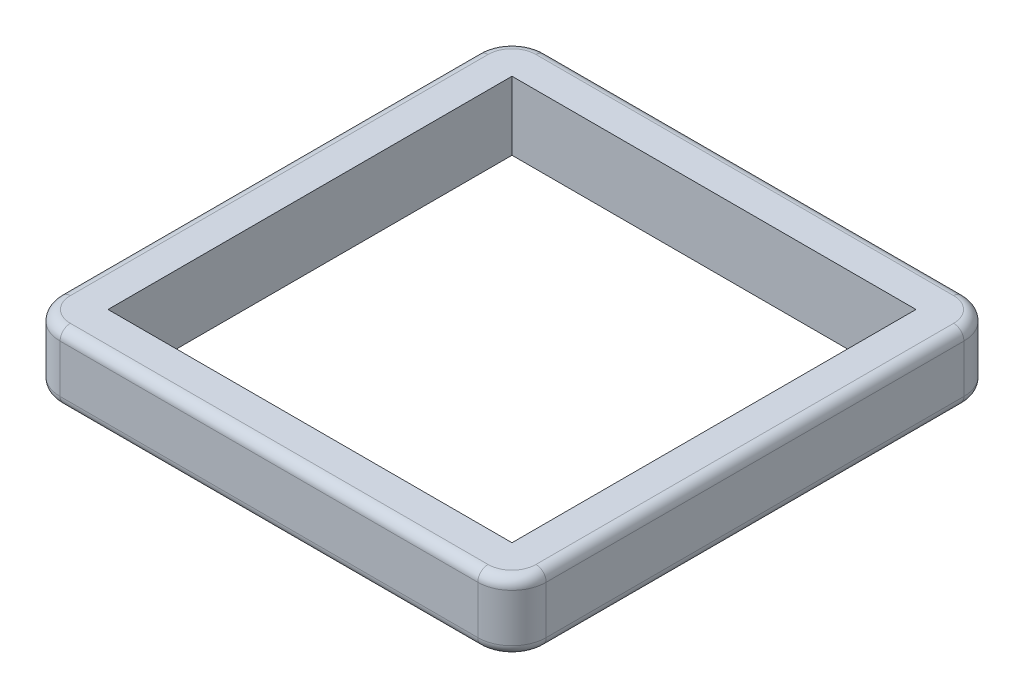
ISO-10303-21;
HEADER;
FILE_DESCRIPTION(('STEP AP214'),'2;1');
FILE_NAME('part.step','',(''),(''),'','','');
FILE_SCHEMA(('AUTOMOTIVE_DESIGN { 1 0 10303 214 1 1 1 1 }'));
ENDSEC;
DATA;
#1=APPLICATION_CONTEXT('core data for automotive mechanical design processes');
#2=APPLICATION_PROTOCOL_DEFINITION('international standard','automotive_design',2000,#1);
#3=PRODUCT_CONTEXT('',#1,'mechanical');
#4=PRODUCT('Part','Part','',(#3));
#5=PRODUCT_RELATED_PRODUCT_CATEGORY('part','',(#4));
#6=PRODUCT_DEFINITION_FORMATION('','',#4);
#7=PRODUCT_DEFINITION_CONTEXT('part definition',#1,'design');
#8=PRODUCT_DEFINITION('design','',#6,#7);
#9=PRODUCT_DEFINITION_SHAPE('','',#8);
#10=(LENGTH_UNIT() NAMED_UNIT(*) SI_UNIT(.MILLI.,.METRE.));
#11=(NAMED_UNIT(*) PLANE_ANGLE_UNIT() SI_UNIT($,.RADIAN.));
#12=(NAMED_UNIT(*) SI_UNIT($,.STERADIAN.) SOLID_ANGLE_UNIT());
#13=UNCERTAINTY_MEASURE_WITH_UNIT(LENGTH_MEASURE(1.E-05),#10,'distance_accuracy_value','');
#14=(GEOMETRIC_REPRESENTATION_CONTEXT(3) GLOBAL_UNCERTAINTY_ASSIGNED_CONTEXT((#13)) GLOBAL_UNIT_ASSIGNED_CONTEXT((#10,
#11,#12)) REPRESENTATION_CONTEXT('',''));
#15=CARTESIAN_POINT('',(0.,0.,0.));
#16=DIRECTION('',(0.,0.,1.));
#17=DIRECTION('',(1.,0.,0.));
#18=AXIS2_PLACEMENT_3D('',#15,#16,#17);
#19=CARTESIAN_POINT('',(0.,127.,0.));
#20=DIRECTION('',(0.,1.,0.));
#21=DIRECTION('',(0.,0.,1.));
#22=AXIS2_PLACEMENT_3D('',#19,#20,#21);
#23=PLANE('',#22);
#24=DIRECTION('',(1.,0.,0.));
#25=VECTOR('',#24,1.);
#26=CARTESIAN_POINT('',(387.35,127.,431.8));
#27=LINE('',#26,#25);
#28=CARTESIAN_POINT('',(-387.35,127.,431.8));
#29=VERTEX_POINT('',#28);
#30=CARTESIAN_POINT('',(387.35,127.,431.8));
#31=VERTEX_POINT('',#30);
#32=EDGE_CURVE('E63',#29,#31,#27,.T.);
#33=ORIENTED_EDGE('',*,*,#32,.T.);
#34=CARTESIAN_POINT('',(387.35,127.,387.35));
#35=DIRECTION('',(0.,1.,0.));
#36=DIRECTION('',(0.,0.,1.));
#37=AXIS2_PLACEMENT_3D('',#34,#35,#36);
#38=CIRCLE('',#37,44.45);
#39=CARTESIAN_POINT('',(431.8,127.,387.35));
#40=VERTEX_POINT('',#39);
#41=EDGE_CURVE('E358',#31,#40,#38,.T.);
#42=ORIENTED_EDGE('',*,*,#41,.T.);
#43=DIRECTION('',(0.,0.,-1.));
#44=VECTOR('',#43,1.);
#45=CARTESIAN_POINT('',(431.8,127.,-387.35));
#46=LINE('',#45,#44);
#47=CARTESIAN_POINT('',(431.8,127.,-387.35));
#48=VERTEX_POINT('',#47);
#49=EDGE_CURVE('E339',#40,#48,#46,.T.);
#50=ORIENTED_EDGE('',*,*,#49,.T.);
#51=CARTESIAN_POINT('',(387.35,127.,-387.35));
#52=DIRECTION('',(0.,1.,0.));
#53=DIRECTION('',(0.,0.,1.));
#54=AXIS2_PLACEMENT_3D('',#51,#52,#53);
#55=CIRCLE('',#54,44.45);
#56=CARTESIAN_POINT('',(387.35,127.,-431.8));
#57=VERTEX_POINT('',#56);
#58=EDGE_CURVE('E342',#48,#57,#55,.T.);
#59=ORIENTED_EDGE('',*,*,#58,.T.);
#60=DIRECTION('',(-1.,0.,0.));
#61=VECTOR('',#60,1.);
#62=CARTESIAN_POINT('',(-387.35,127.,-431.8));
#63=LINE('',#62,#61);
#64=CARTESIAN_POINT('',(-387.35,127.,-431.8));
#65=VERTEX_POINT('',#64);
#66=EDGE_CURVE('E345',#57,#65,#63,.T.);
#67=ORIENTED_EDGE('',*,*,#66,.T.);
#68=CARTESIAN_POINT('',(-387.35,127.,-387.35));
#69=DIRECTION('',(0.,1.,0.));
#70=DIRECTION('',(0.,0.,1.));
#71=AXIS2_PLACEMENT_3D('',#68,#69,#70);
#72=CIRCLE('',#71,44.45);
#73=CARTESIAN_POINT('',(-431.8,127.,-387.35));
#74=VERTEX_POINT('',#73);
#75=EDGE_CURVE('E348',#65,#74,#72,.T.);
#76=ORIENTED_EDGE('',*,*,#75,.T.);
#77=DIRECTION('',(0.,0.,1.));
#78=VECTOR('',#77,1.);
#79=CARTESIAN_POINT('',(-431.8,127.,387.35));
#80=LINE('',#79,#78);
#81=CARTESIAN_POINT('',(-431.8,127.,387.35));
#82=VERTEX_POINT('',#81);
#83=EDGE_CURVE('E351',#74,#82,#80,.T.);
#84=ORIENTED_EDGE('',*,*,#83,.T.);
#85=CARTESIAN_POINT('',(-387.35,127.,387.35));
#86=DIRECTION('',(0.,1.,0.));
#87=DIRECTION('',(0.,0.,1.));
#88=AXIS2_PLACEMENT_3D('',#85,#86,#87);
#89=CIRCLE('',#88,44.45);
#90=EDGE_CURVE('E68',#82,#29,#89,.T.);
#91=ORIENTED_EDGE('',*,*,#90,.T.);
#92=EDGE_LOOP('',(#33,#42,#50,#59,#67,#76,#84,#91));
#93=FACE_BOUND('',#92,.T.);
#94=DIRECTION('',(-1.,0.,0.));
#95=VECTOR('',#94,1.);
#96=CARTESIAN_POINT('',(-374.65,127.,-374.65));
#97=LINE('',#96,#95);
#98=CARTESIAN_POINT('',(374.65,127.,-374.65));
#99=VERTEX_POINT('',#98);
#100=CARTESIAN_POINT('',(-374.65,127.,-374.65));
#101=VERTEX_POINT('',#100);
#102=EDGE_CURVE('E196',#99,#101,#97,.T.);
#103=ORIENTED_EDGE('',*,*,#102,.F.);
#104=DIRECTION('',(0.,0.,-1.));
#105=VECTOR('',#104,1.);
#106=CARTESIAN_POINT('',(374.65,127.,-374.65));
#107=LINE('',#106,#105);
#108=CARTESIAN_POINT('',(374.65,127.,374.65));
#109=VERTEX_POINT('',#108);
#110=EDGE_CURVE('E185',#109,#99,#107,.T.);
#111=ORIENTED_EDGE('',*,*,#110,.F.);
#112=DIRECTION('',(1.,0.,0.));
#113=VECTOR('',#112,1.);
#114=CARTESIAN_POINT('',(-374.65,127.,374.65));
#115=LINE('',#114,#113);
#116=CARTESIAN_POINT('',(-374.65,127.,374.65));
#117=VERTEX_POINT('',#116);
#118=EDGE_CURVE('E214',#117,#109,#115,.T.);
#119=ORIENTED_EDGE('',*,*,#118,.F.);
#120=DIRECTION('',(0.,0.,1.));
#121=VECTOR('',#120,1.);
#122=CARTESIAN_POINT('',(-374.65,127.,-374.65));
#123=LINE('',#122,#121);
#124=EDGE_CURVE('E210',#101,#117,#123,.T.);
#125=ORIENTED_EDGE('',*,*,#124,.F.);
#126=EDGE_LOOP('',(#103,#111,#119,#125));
#127=FACE_BOUND('',#126,.T.);
#128=ADVANCED_FACE('F45',(#93,#127),#23,.T.);
#129=CARTESIAN_POINT('',(0.,0.,0.));
#130=DIRECTION('',(0.,1.,0.));
#131=DIRECTION('',(0.,0.,1.));
#132=AXIS2_PLACEMENT_3D('',#129,#130,#131);
#133=PLANE('',#132);
#134=DIRECTION('',(0.,0.,-1.));
#135=VECTOR('',#134,1.);
#136=CARTESIAN_POINT('',(431.8,0.,0.));
#137=LINE('',#136,#135);
#138=CARTESIAN_POINT('',(431.8,0.,-387.35));
#139=VERTEX_POINT('',#138);
#140=CARTESIAN_POINT('',(431.8,0.,387.35));
#141=VERTEX_POINT('',#140);
#142=EDGE_CURVE('E270',#139,#141,#137,.F.);
#143=ORIENTED_EDGE('',*,*,#142,.T.);
#144=CARTESIAN_POINT('',(387.35,0.,387.35));
#145=DIRECTION('',(0.,1.,0.));
#146=DIRECTION('',(0.,0.,1.));
#147=AXIS2_PLACEMENT_3D('',#144,#145,#146);
#148=CIRCLE('',#147,44.45);
#149=CARTESIAN_POINT('',(387.35,0.,431.8));
#150=VERTEX_POINT('',#149);
#151=EDGE_CURVE('E291',#141,#150,#148,.F.);
#152=ORIENTED_EDGE('',*,*,#151,.T.);
#153=DIRECTION('',(1.,0.,0.));
#154=VECTOR('',#153,1.);
#155=CARTESIAN_POINT('',(0.,0.,431.8));
#156=LINE('',#155,#154);
#157=CARTESIAN_POINT('',(-387.35,0.,431.8));
#158=VERTEX_POINT('',#157);
#159=EDGE_CURVE('E288',#150,#158,#156,.F.);
#160=ORIENTED_EDGE('',*,*,#159,.T.);
#161=CARTESIAN_POINT('',(-387.35,0.,387.35));
#162=DIRECTION('',(0.,1.,0.));
#163=DIRECTION('',(0.,0.,1.));
#164=AXIS2_PLACEMENT_3D('',#161,#162,#163);
#165=CIRCLE('',#164,44.45);
#166=CARTESIAN_POINT('',(-431.8,0.,387.35));
#167=VERTEX_POINT('',#166);
#168=EDGE_CURVE('E285',#158,#167,#165,.F.);
#169=ORIENTED_EDGE('',*,*,#168,.T.);
#170=DIRECTION('',(0.,0.,1.));
#171=VECTOR('',#170,1.);
#172=CARTESIAN_POINT('',(-431.8,0.,0.));
#173=LINE('',#172,#171);
#174=CARTESIAN_POINT('',(-431.8,0.,-387.35));
#175=VERTEX_POINT('',#174);
#176=EDGE_CURVE('E282',#167,#175,#173,.F.);
#177=ORIENTED_EDGE('',*,*,#176,.T.);
#178=CARTESIAN_POINT('',(-387.35,0.,-387.35));
#179=DIRECTION('',(0.,1.,0.));
#180=DIRECTION('',(0.,0.,1.));
#181=AXIS2_PLACEMENT_3D('',#178,#179,#180);
#182=CIRCLE('',#181,44.45);
#183=CARTESIAN_POINT('',(-387.35,0.,-431.8));
#184=VERTEX_POINT('',#183);
#185=EDGE_CURVE('E279',#175,#184,#182,.F.);
#186=ORIENTED_EDGE('',*,*,#185,.T.);
#187=DIRECTION('',(-1.,0.,0.));
#188=VECTOR('',#187,1.);
#189=CARTESIAN_POINT('',(0.,0.,-431.8));
#190=LINE('',#189,#188);
#191=CARTESIAN_POINT('',(387.35,0.,-431.8));
#192=VERTEX_POINT('',#191);
#193=EDGE_CURVE('E276',#184,#192,#190,.F.);
#194=ORIENTED_EDGE('',*,*,#193,.T.);
#195=CARTESIAN_POINT('',(387.35,0.,-387.35));
#196=DIRECTION('',(0.,1.,0.));
#197=DIRECTION('',(0.,0.,1.));
#198=AXIS2_PLACEMENT_3D('',#195,#196,#197);
#199=CIRCLE('',#198,44.45);
#200=EDGE_CURVE('E273',#192,#139,#199,.F.);
#201=ORIENTED_EDGE('',*,*,#200,.T.);
#202=EDGE_LOOP('',(#143,#152,#160,#169,#177,#186,#194,#201));
#203=FACE_BOUND('',#202,.T.);
#204=DIRECTION('',(0.,0.,-1.));
#205=VECTOR('',#204,1.);
#206=CARTESIAN_POINT('',(374.65,0.,-374.65));
#207=LINE('',#206,#205);
#208=CARTESIAN_POINT('',(374.65,0.,374.65));
#209=VERTEX_POINT('',#208);
#210=CARTESIAN_POINT('',(374.65,0.,-374.65));
#211=VERTEX_POINT('',#210);
#212=EDGE_CURVE('E219',#209,#211,#207,.T.);
#213=ORIENTED_EDGE('',*,*,#212,.T.);
#214=DIRECTION('',(-1.,0.,0.));
#215=VECTOR('',#214,1.);
#216=CARTESIAN_POINT('',(-374.65,0.,-374.65));
#217=LINE('',#216,#215);
#218=CARTESIAN_POINT('',(-374.65,0.,-374.65));
#219=VERTEX_POINT('',#218);
#220=EDGE_CURVE('E203',#211,#219,#217,.T.);
#221=ORIENTED_EDGE('',*,*,#220,.T.);
#222=DIRECTION('',(0.,0.,1.));
#223=VECTOR('',#222,1.);
#224=CARTESIAN_POINT('',(-374.65,0.,-374.65));
#225=LINE('',#224,#223);
#226=CARTESIAN_POINT('',(-374.65,0.,374.65));
#227=VERTEX_POINT('',#226);
#228=EDGE_CURVE('E225',#219,#227,#225,.T.);
#229=ORIENTED_EDGE('',*,*,#228,.T.);
#230=DIRECTION('',(1.,0.,0.));
#231=VECTOR('',#230,1.);
#232=CARTESIAN_POINT('',(-374.65,0.,374.65));
#233=LINE('',#232,#231);
#234=EDGE_CURVE('E197',#227,#209,#233,.T.);
#235=ORIENTED_EDGE('',*,*,#234,.T.);
#236=EDGE_LOOP('',(#213,#221,#229,#235));
#237=FACE_BOUND('',#236,.T.);
#238=ADVANCED_FACE('F452',(#203,#237),#133,.F.);
#239=CARTESIAN_POINT('',(-450.85,127.,-450.85));
#240=DIRECTION('',(1.,0.,0.));
#241=DIRECTION('',(0.,0.,-1.));
#242=AXIS2_PLACEMENT_3D('',#239,#240,#241);
#243=PLANE('',#242);
#244=DIRECTION('',(0.,-1.,0.));
#245=VECTOR('',#244,1.);
#246=CARTESIAN_POINT('',(-450.85,127.,-387.35));
#247=LINE('',#246,#245);
#248=CARTESIAN_POINT('',(-450.85,107.95,-387.35));
#249=VERTEX_POINT('',#248);
#250=CARTESIAN_POINT('',(-450.85,19.05,-387.35));
#251=VERTEX_POINT('',#250);
#252=EDGE_CURVE('E242',#249,#251,#247,.T.);
#253=ORIENTED_EDGE('',*,*,#252,.T.);
#254=DIRECTION('',(0.,0.,1.));
#255=VECTOR('',#254,1.);
#256=CARTESIAN_POINT('',(-450.85,19.05,-450.85));
#257=LINE('',#256,#255);
#258=CARTESIAN_POINT('',(-450.85,19.05,387.35));
#259=VERTEX_POINT('',#258);
#260=EDGE_CURVE('E318',#251,#259,#257,.T.);
#261=ORIENTED_EDGE('',*,*,#260,.T.);
#262=DIRECTION('',(0.,-1.,0.));
#263=VECTOR('',#262,1.);
#264=CARTESIAN_POINT('',(-450.85,127.,387.35));
#265=LINE('',#264,#263);
#266=CARTESIAN_POINT('',(-450.85,107.95,387.35));
#267=VERTEX_POINT('',#266);
#268=EDGE_CURVE('E205',#259,#267,#265,.F.);
#269=ORIENTED_EDGE('',*,*,#268,.T.);
#270=DIRECTION('',(0.,0.,1.));
#271=VECTOR('',#270,1.);
#272=CARTESIAN_POINT('',(-450.85,107.95,-387.35));
#273=LINE('',#272,#271);
#274=EDGE_CURVE('E315',#267,#249,#273,.F.);
#275=ORIENTED_EDGE('',*,*,#274,.T.);
#276=EDGE_LOOP('',(#253,#261,#269,#275));
#277=FACE_BOUND('',#276,.T.);
#278=ADVANCED_FACE('F462',(#277),#243,.F.);
#279=CARTESIAN_POINT('',(-450.85,127.,450.85));
#280=DIRECTION('',(0.,0.,-1.));
#281=DIRECTION('',(-1.,0.,0.));
#282=AXIS2_PLACEMENT_3D('',#279,#280,#281);
#283=PLANE('',#282);
#284=DIRECTION('',(0.,-1.,0.));
#285=VECTOR('',#284,1.);
#286=CARTESIAN_POINT('',(-387.35,127.,450.85));
#287=LINE('',#286,#285);
#288=CARTESIAN_POINT('',(-387.35,107.95,450.85));
#289=VERTEX_POINT('',#288);
#290=CARTESIAN_POINT('',(-387.35,19.05,450.85));
#291=VERTEX_POINT('',#290);
#292=EDGE_CURVE('E262',#289,#291,#287,.T.);
#293=ORIENTED_EDGE('',*,*,#292,.T.);
#294=DIRECTION('',(1.,0.,0.));
#295=VECTOR('',#294,1.);
#296=CARTESIAN_POINT('',(-450.85,19.05,450.85));
#297=LINE('',#296,#295);
#298=CARTESIAN_POINT('',(387.35,19.05,450.85));
#299=VERTEX_POINT('',#298);
#300=EDGE_CURVE('E306',#291,#299,#297,.T.);
#301=ORIENTED_EDGE('',*,*,#300,.T.);
#302=DIRECTION('',(0.,-1.,0.));
#303=VECTOR('',#302,1.);
#304=CARTESIAN_POINT('',(387.35,127.,450.85));
#305=LINE('',#304,#303);
#306=CARTESIAN_POINT('',(387.35,107.95,450.85));
#307=VERTEX_POINT('',#306);
#308=EDGE_CURVE('E266',#299,#307,#305,.F.);
#309=ORIENTED_EDGE('',*,*,#308,.T.);
#310=DIRECTION('',(1.,0.,0.));
#311=VECTOR('',#310,1.);
#312=CARTESIAN_POINT('',(-387.35,107.95,450.85));
#313=LINE('',#312,#311);
#314=EDGE_CURVE('E303',#307,#289,#313,.F.);
#315=ORIENTED_EDGE('',*,*,#314,.T.);
#316=EDGE_LOOP('',(#293,#301,#309,#315));
#317=FACE_BOUND('',#316,.T.);
#318=ADVANCED_FACE('F483',(#317),#283,.F.);
#319=CARTESIAN_POINT('',(450.85,127.,-450.85));
#320=DIRECTION('',(-1.,0.,0.));
#321=DIRECTION('',(0.,0.,1.));
#322=AXIS2_PLACEMENT_3D('',#319,#320,#321);
#323=PLANE('',#322);
#324=DIRECTION('',(0.,-1.,0.));
#325=VECTOR('',#324,1.);
#326=CARTESIAN_POINT('',(450.85,127.,387.35));
#327=LINE('',#326,#325);
#328=CARTESIAN_POINT('',(450.85,107.95,387.35));
#329=VERTEX_POINT('',#328);
#330=CARTESIAN_POINT('',(450.85,19.05,387.35));
#331=VERTEX_POINT('',#330);
#332=EDGE_CURVE('E254',#329,#331,#327,.T.);
#333=ORIENTED_EDGE('',*,*,#332,.T.);
#334=DIRECTION('',(0.,0.,-1.));
#335=VECTOR('',#334,1.);
#336=CARTESIAN_POINT('',(450.85,19.05,-450.85));
#337=LINE('',#336,#335);
#338=CARTESIAN_POINT('',(450.85,19.05,-387.35));
#339=VERTEX_POINT('',#338);
#340=EDGE_CURVE('E11',#331,#339,#337,.T.);
#341=ORIENTED_EDGE('',*,*,#340,.T.);
#342=DIRECTION('',(0.,-1.,0.));
#343=VECTOR('',#342,1.);
#344=CARTESIAN_POINT('',(450.85,127.,-387.35));
#345=LINE('',#344,#343);
#346=CARTESIAN_POINT('',(450.85,107.95,-387.35));
#347=VERTEX_POINT('',#346);
#348=EDGE_CURVE('E258',#339,#347,#345,.F.);
#349=ORIENTED_EDGE('',*,*,#348,.T.);
#350=DIRECTION('',(0.,0.,-1.));
#351=VECTOR('',#350,1.);
#352=CARTESIAN_POINT('',(450.85,107.95,387.35));
#353=LINE('',#352,#351);
#354=EDGE_CURVE('E55',#347,#329,#353,.F.);
#355=ORIENTED_EDGE('',*,*,#354,.T.);
#356=EDGE_LOOP('',(#333,#341,#349,#355));
#357=FACE_BOUND('',#356,.T.);
#358=ADVANCED_FACE('F497',(#357),#323,.F.);
#359=CARTESIAN_POINT('',(-450.85,127.,-450.85));
#360=DIRECTION('',(0.,0.,1.));
#361=DIRECTION('',(1.,0.,0.));
#362=AXIS2_PLACEMENT_3D('',#359,#360,#361);
#363=PLANE('',#362);
#364=DIRECTION('',(0.,-1.,0.));
#365=VECTOR('',#364,1.);
#366=CARTESIAN_POINT('',(387.35,127.,-450.85));
#367=LINE('',#366,#365);
#368=CARTESIAN_POINT('',(387.35,107.95,-450.85));
#369=VERTEX_POINT('',#368);
#370=CARTESIAN_POINT('',(387.35,19.05,-450.85));
#371=VERTEX_POINT('',#370);
#372=EDGE_CURVE('E246',#369,#371,#367,.T.);
#373=ORIENTED_EDGE('',*,*,#372,.T.);
#374=DIRECTION('',(-1.,0.,0.));
#375=VECTOR('',#374,1.);
#376=CARTESIAN_POINT('',(-450.85,19.05,-450.85));
#377=LINE('',#376,#375);
#378=CARTESIAN_POINT('',(-387.35,19.05,-450.85));
#379=VERTEX_POINT('',#378);
#380=EDGE_CURVE('E330',#371,#379,#377,.T.);
#381=ORIENTED_EDGE('',*,*,#380,.T.);
#382=DIRECTION('',(0.,-1.,0.));
#383=VECTOR('',#382,1.);
#384=CARTESIAN_POINT('',(-387.35,127.,-450.85));
#385=LINE('',#384,#383);
#386=CARTESIAN_POINT('',(-387.35,107.95,-450.85));
#387=VERTEX_POINT('',#386);
#388=EDGE_CURVE('E250',#379,#387,#385,.F.);
#389=ORIENTED_EDGE('',*,*,#388,.T.);
#390=DIRECTION('',(-1.,0.,0.));
#391=VECTOR('',#390,1.);
#392=CARTESIAN_POINT('',(387.35,107.95,-450.85));
#393=LINE('',#392,#391);
#394=EDGE_CURVE('E327',#387,#369,#393,.F.);
#395=ORIENTED_EDGE('',*,*,#394,.T.);
#396=EDGE_LOOP('',(#373,#381,#389,#395));
#397=FACE_BOUND('',#396,.T.);
#398=ADVANCED_FACE('F437',(#397),#363,.F.);
#399=CARTESIAN_POINT('',(374.65,127.,-374.65));
#400=DIRECTION('',(-1.,0.,0.));
#401=DIRECTION('',(0.,0.,1.));
#402=AXIS2_PLACEMENT_3D('',#399,#400,#401);
#403=PLANE('',#402);
#404=ORIENTED_EDGE('',*,*,#212,.F.);
#405=DIRECTION('',(0.,-1.,0.));
#406=VECTOR('',#405,1.);
#407=CARTESIAN_POINT('',(374.65,127.,374.65));
#408=LINE('',#407,#406);
#409=EDGE_CURVE('E191',#109,#209,#408,.T.);
#410=ORIENTED_EDGE('',*,*,#409,.F.);
#411=ORIENTED_EDGE('',*,*,#110,.T.);
#412=DIRECTION('',(0.,-1.,0.));
#413=VECTOR('',#412,1.);
#414=CARTESIAN_POINT('',(374.65,127.,-374.65));
#415=LINE('',#414,#413);
#416=EDGE_CURVE('E188',#99,#211,#415,.T.);
#417=ORIENTED_EDGE('',*,*,#416,.T.);
#418=EDGE_LOOP('',(#404,#410,#411,#417));
#419=FACE_BOUND('',#418,.T.);
#420=ADVANCED_FACE('F187',(#419),#403,.T.);
#421=CARTESIAN_POINT('',(-374.65,127.,-374.65));
#422=DIRECTION('',(0.,0.,1.));
#423=DIRECTION('',(1.,0.,0.));
#424=AXIS2_PLACEMENT_3D('',#421,#422,#423);
#425=PLANE('',#424);
#426=ORIENTED_EDGE('',*,*,#220,.F.);
#427=ORIENTED_EDGE('',*,*,#416,.F.);
#428=ORIENTED_EDGE('',*,*,#102,.T.);
#429=DIRECTION('',(0.,-1.,0.));
#430=VECTOR('',#429,1.);
#431=CARTESIAN_POINT('',(-374.65,127.,-374.65));
#432=LINE('',#431,#430);
#433=EDGE_CURVE('E206',#101,#219,#432,.T.);
#434=ORIENTED_EDGE('',*,*,#433,.T.);
#435=EDGE_LOOP('',(#426,#427,#428,#434));
#436=FACE_BOUND('',#435,.T.);
#437=ADVANCED_FACE('F200',(#436),#425,.T.);
#438=CARTESIAN_POINT('',(-374.65,127.,-374.65));
#439=DIRECTION('',(1.,0.,0.));
#440=DIRECTION('',(0.,0.,-1.));
#441=AXIS2_PLACEMENT_3D('',#438,#439,#440);
#442=PLANE('',#441);
#443=ORIENTED_EDGE('',*,*,#228,.F.);
#444=ORIENTED_EDGE('',*,*,#433,.F.);
#445=ORIENTED_EDGE('',*,*,#124,.T.);
#446=DIRECTION('',(0.,-1.,0.));
#447=VECTOR('',#446,1.);
#448=CARTESIAN_POINT('',(-374.65,127.,374.65));
#449=LINE('',#448,#447);
#450=EDGE_CURVE('E234',#117,#227,#449,.T.);
#451=ORIENTED_EDGE('',*,*,#450,.T.);
#452=EDGE_LOOP('',(#443,#444,#445,#451));
#453=FACE_BOUND('',#452,.T.);
#454=ADVANCED_FACE('F736',(#453),#442,.T.);
#455=CARTESIAN_POINT('',(-374.65,127.,374.65));
#456=DIRECTION('',(0.,0.,-1.));
#457=DIRECTION('',(-1.,0.,0.));
#458=AXIS2_PLACEMENT_3D('',#455,#456,#457);
#459=PLANE('',#458);
#460=ORIENTED_EDGE('',*,*,#234,.F.);
#461=ORIENTED_EDGE('',*,*,#450,.F.);
#462=ORIENTED_EDGE('',*,*,#118,.T.);
#463=ORIENTED_EDGE('',*,*,#409,.T.);
#464=EDGE_LOOP('',(#460,#461,#462,#463));
#465=FACE_BOUND('',#464,.T.);
#466=ADVANCED_FACE('F547',(#465),#459,.T.);
#467=CARTESIAN_POINT('',(-387.35,127.,-387.35));
#468=DIRECTION('',(0.,-1.,0.));
#469=DIRECTION('',(0.,0.,-1.));
#470=AXIS2_PLACEMENT_3D('',#467,#468,#469);
#471=CYLINDRICAL_SURFACE('',#470,63.5);
#472=ORIENTED_EDGE('',*,*,#388,.F.);
#473=CARTESIAN_POINT('',(-387.35,19.05,-387.35));
#474=DIRECTION('',(0.,1.,0.));
#475=DIRECTION('',(0.,0.,1.));
#476=AXIS2_PLACEMENT_3D('',#473,#474,#475);
#477=CIRCLE('',#476,63.5);
#478=EDGE_CURVE('E324',#379,#251,#477,.T.);
#479=ORIENTED_EDGE('',*,*,#478,.T.);
#480=ORIENTED_EDGE('',*,*,#252,.F.);
#481=CARTESIAN_POINT('',(-387.35,107.95,-387.35));
#482=DIRECTION('',(0.,1.,0.));
#483=DIRECTION('',(0.,0.,1.));
#484=AXIS2_PLACEMENT_3D('',#481,#482,#483);
#485=CIRCLE('',#484,63.5);
#486=EDGE_CURVE('E321',#249,#387,#485,.F.);
#487=ORIENTED_EDGE('',*,*,#486,.T.);
#488=EDGE_LOOP('',(#472,#479,#480,#487));
#489=FACE_BOUND('',#488,.T.);
#490=ADVANCED_FACE('F434',(#489),#471,.T.);
#491=CARTESIAN_POINT('',(387.35,127.,-387.35));
#492=DIRECTION('',(0.,-1.,0.));
#493=DIRECTION('',(0.,0.,-1.));
#494=AXIS2_PLACEMENT_3D('',#491,#492,#493);
#495=CYLINDRICAL_SURFACE('',#494,63.5);
#496=ORIENTED_EDGE('',*,*,#348,.F.);
#497=CARTESIAN_POINT('',(387.35,19.05,-387.35));
#498=DIRECTION('',(0.,1.,0.));
#499=DIRECTION('',(0.,0.,1.));
#500=AXIS2_PLACEMENT_3D('',#497,#498,#499);
#501=CIRCLE('',#500,63.5);
#502=EDGE_CURVE('E336',#339,#371,#501,.T.);
#503=ORIENTED_EDGE('',*,*,#502,.T.);
#504=ORIENTED_EDGE('',*,*,#372,.F.);
#505=CARTESIAN_POINT('',(387.35,107.95,-387.35));
#506=DIRECTION('',(0.,1.,0.));
#507=DIRECTION('',(0.,0.,1.));
#508=AXIS2_PLACEMENT_3D('',#505,#506,#507);
#509=CIRCLE('',#508,63.5);
#510=EDGE_CURVE('E333',#369,#347,#509,.F.);
#511=ORIENTED_EDGE('',*,*,#510,.T.);
#512=EDGE_LOOP('',(#496,#503,#504,#511));
#513=FACE_BOUND('',#512,.T.);
#514=ADVANCED_FACE('F500',(#513),#495,.T.);
#515=CARTESIAN_POINT('',(387.35,127.,387.35));
#516=DIRECTION('',(0.,-1.,0.));
#517=DIRECTION('',(0.,0.,-1.));
#518=AXIS2_PLACEMENT_3D('',#515,#516,#517);
#519=CYLINDRICAL_SURFACE('',#518,63.5);
#520=ORIENTED_EDGE('',*,*,#308,.F.);
#521=CARTESIAN_POINT('',(387.35,19.05,387.35));
#522=DIRECTION('',(0.,1.,0.));
#523=DIRECTION('',(0.,0.,1.));
#524=AXIS2_PLACEMENT_3D('',#521,#522,#523);
#525=CIRCLE('',#524,63.5);
#526=EDGE_CURVE('E299',#299,#331,#525,.T.);
#527=ORIENTED_EDGE('',*,*,#526,.T.);
#528=ORIENTED_EDGE('',*,*,#332,.F.);
#529=CARTESIAN_POINT('',(387.35,107.95,387.35));
#530=DIRECTION('',(0.,1.,0.));
#531=DIRECTION('',(0.,0.,1.));
#532=AXIS2_PLACEMENT_3D('',#529,#530,#531);
#533=CIRCLE('',#532,63.5);
#534=EDGE_CURVE('E295',#329,#307,#533,.F.);
#535=ORIENTED_EDGE('',*,*,#534,.T.);
#536=EDGE_LOOP('',(#520,#527,#528,#535));
#537=FACE_BOUND('',#536,.T.);
#538=ADVANCED_FACE('F486',(#537),#519,.T.);
#539=CARTESIAN_POINT('',(-387.35,127.,387.35));
#540=DIRECTION('',(0.,-1.,0.));
#541=DIRECTION('',(0.,0.,-1.));
#542=AXIS2_PLACEMENT_3D('',#539,#540,#541);
#543=CYLINDRICAL_SURFACE('',#542,63.5);
#544=ORIENTED_EDGE('',*,*,#268,.F.);
#545=CARTESIAN_POINT('',(-387.35,19.05,387.35));
#546=DIRECTION('',(0.,1.,0.));
#547=DIRECTION('',(0.,0.,1.));
#548=AXIS2_PLACEMENT_3D('',#545,#546,#547);
#549=CIRCLE('',#548,63.5);
#550=EDGE_CURVE('E312',#259,#291,#549,.T.);
#551=ORIENTED_EDGE('',*,*,#550,.T.);
#552=ORIENTED_EDGE('',*,*,#292,.F.);
#553=CARTESIAN_POINT('',(-387.35,107.95,387.35));
#554=DIRECTION('',(0.,1.,0.));
#555=DIRECTION('',(0.,0.,1.));
#556=AXIS2_PLACEMENT_3D('',#553,#554,#555);
#557=CIRCLE('',#556,63.5);
#558=EDGE_CURVE('E309',#289,#267,#557,.F.);
#559=ORIENTED_EDGE('',*,*,#558,.T.);
#560=EDGE_LOOP('',(#544,#551,#552,#559));
#561=FACE_BOUND('',#560,.T.);
#562=ADVANCED_FACE('F466',(#561),#543,.T.);
#563=CARTESIAN_POINT('',(-387.35,19.05,-387.35));
#564=DIRECTION('',(0.,1.,0.));
#565=DIRECTION('',(0.,0.,1.));
#566=AXIS2_PLACEMENT_3D('',#563,#564,#565);
#567=TOROIDAL_SURFACE('',#566,44.45,19.05);
#568=CARTESIAN_POINT('',(-431.8,19.05,-387.35));
#569=DIRECTION('',(0.,0.,1.));
#570=DIRECTION('',(1.,0.,0.));
#571=AXIS2_PLACEMENT_3D('',#568,#569,#570);
#572=CIRCLE('',#571,19.05);
#573=EDGE_CURVE('E385',#251,#175,#572,.T.);
#574=ORIENTED_EDGE('',*,*,#573,.F.);
#575=ORIENTED_EDGE('',*,*,#478,.F.);
#576=CARTESIAN_POINT('',(-387.35,19.05,-431.8));
#577=DIRECTION('',(1.,0.,0.));
#578=DIRECTION('',(0.,0.,-1.));
#579=AXIS2_PLACEMENT_3D('',#576,#577,#578);
#580=CIRCLE('',#579,19.05);
#581=EDGE_CURVE('E222',#184,#379,#580,.T.);
#582=ORIENTED_EDGE('',*,*,#581,.F.);
#583=ORIENTED_EDGE('',*,*,#185,.F.);
#584=EDGE_LOOP('',(#574,#575,#582,#583));
#585=FACE_BOUND('',#584,.T.);
#586=ADVANCED_FACE('F459',(#585),#567,.T.);
#587=CARTESIAN_POINT('',(-450.85,19.05,-431.8));
#588=DIRECTION('',(-1.,0.,0.));
#589=DIRECTION('',(0.,0.,1.));
#590=AXIS2_PLACEMENT_3D('',#587,#588,#589);
#591=CYLINDRICAL_SURFACE('',#590,19.05);
#592=ORIENTED_EDGE('',*,*,#581,.T.);
#593=ORIENTED_EDGE('',*,*,#380,.F.);
#594=CARTESIAN_POINT('',(387.35,19.05,-431.8));
#595=DIRECTION('',(1.,0.,0.));
#596=DIRECTION('',(0.,0.,-1.));
#597=AXIS2_PLACEMENT_3D('',#594,#595,#596);
#598=CIRCLE('',#597,19.05);
#599=EDGE_CURVE('E381',#192,#371,#598,.T.);
#600=ORIENTED_EDGE('',*,*,#599,.F.);
#601=ORIENTED_EDGE('',*,*,#193,.F.);
#602=EDGE_LOOP('',(#592,#593,#600,#601));
#603=FACE_BOUND('',#602,.T.);
#604=ADVANCED_FACE('F442',(#603),#591,.T.);
#605=CARTESIAN_POINT('',(-431.8,19.05,-450.85));
#606=DIRECTION('',(0.,0.,1.));
#607=DIRECTION('',(1.,0.,0.));
#608=AXIS2_PLACEMENT_3D('',#605,#606,#607);
#609=CYLINDRICAL_SURFACE('',#608,19.05);
#610=ORIENTED_EDGE('',*,*,#573,.T.);
#611=ORIENTED_EDGE('',*,*,#176,.F.);
#612=CARTESIAN_POINT('',(-431.8,19.05,387.35));
#613=DIRECTION('',(0.,0.,1.));
#614=DIRECTION('',(1.,0.,0.));
#615=AXIS2_PLACEMENT_3D('',#612,#613,#614);
#616=CIRCLE('',#615,19.05);
#617=EDGE_CURVE('E377',#259,#167,#616,.T.);
#618=ORIENTED_EDGE('',*,*,#617,.F.);
#619=ORIENTED_EDGE('',*,*,#260,.F.);
#620=EDGE_LOOP('',(#610,#611,#618,#619));
#621=FACE_BOUND('',#620,.T.);
#622=ADVANCED_FACE('F471',(#621),#609,.T.);
#623=CARTESIAN_POINT('',(387.35,19.05,-387.35));
#624=DIRECTION('',(0.,1.,0.));
#625=DIRECTION('',(0.,0.,1.));
#626=AXIS2_PLACEMENT_3D('',#623,#624,#625);
#627=TOROIDAL_SURFACE('',#626,44.45,19.05);
#628=ORIENTED_EDGE('',*,*,#599,.T.);
#629=ORIENTED_EDGE('',*,*,#502,.F.);
#630=CARTESIAN_POINT('',(431.8,19.05,-387.35));
#631=DIRECTION('',(0.,0.,1.));
#632=DIRECTION('',(1.,0.,0.));
#633=AXIS2_PLACEMENT_3D('',#630,#631,#632);
#634=CIRCLE('',#633,19.05);
#635=EDGE_CURVE('E373',#139,#339,#634,.T.);
#636=ORIENTED_EDGE('',*,*,#635,.F.);
#637=ORIENTED_EDGE('',*,*,#200,.F.);
#638=EDGE_LOOP('',(#628,#629,#636,#637));
#639=FACE_BOUND('',#638,.T.);
#640=ADVANCED_FACE('F448',(#639),#627,.T.);
#641=CARTESIAN_POINT('',(-387.35,19.05,387.35));
#642=DIRECTION('',(0.,1.,0.));
#643=DIRECTION('',(0.,0.,1.));
#644=AXIS2_PLACEMENT_3D('',#641,#642,#643);
#645=TOROIDAL_SURFACE('',#644,44.45,19.05);
#646=ORIENTED_EDGE('',*,*,#617,.T.);
#647=ORIENTED_EDGE('',*,*,#168,.F.);
#648=CARTESIAN_POINT('',(-387.35,19.05,431.8));
#649=DIRECTION('',(1.,0.,0.));
#650=DIRECTION('',(0.,0.,-1.));
#651=AXIS2_PLACEMENT_3D('',#648,#649,#650);
#652=CIRCLE('',#651,19.05);
#653=EDGE_CURVE('E369',#291,#158,#652,.T.);
#654=ORIENTED_EDGE('',*,*,#653,.F.);
#655=ORIENTED_EDGE('',*,*,#550,.F.);
#656=EDGE_LOOP('',(#646,#647,#654,#655));
#657=FACE_BOUND('',#656,.T.);
#658=ADVANCED_FACE('F475',(#657),#645,.T.);
#659=CARTESIAN_POINT('',(431.8,19.05,-450.85));
#660=DIRECTION('',(0.,0.,-1.));
#661=DIRECTION('',(-1.,0.,0.));
#662=AXIS2_PLACEMENT_3D('',#659,#660,#661);
#663=CYLINDRICAL_SURFACE('',#662,19.05);
#664=ORIENTED_EDGE('',*,*,#635,.T.);
#665=ORIENTED_EDGE('',*,*,#340,.F.);
#666=CARTESIAN_POINT('',(431.8,19.05,387.35));
#667=DIRECTION('',(0.,0.,1.));
#668=DIRECTION('',(1.,0.,0.));
#669=AXIS2_PLACEMENT_3D('',#666,#667,#668);
#670=CIRCLE('',#669,19.05);
#671=EDGE_CURVE('E366',#141,#331,#670,.T.);
#672=ORIENTED_EDGE('',*,*,#671,.F.);
#673=ORIENTED_EDGE('',*,*,#142,.F.);
#674=EDGE_LOOP('',(#664,#665,#672,#673));
#675=FACE_BOUND('',#674,.T.);
#676=ADVANCED_FACE('F494',(#675),#663,.T.);
#677=CARTESIAN_POINT('',(-450.85,19.05,431.8));
#678=DIRECTION('',(1.,0.,0.));
#679=DIRECTION('',(0.,0.,-1.));
#680=AXIS2_PLACEMENT_3D('',#677,#678,#679);
#681=CYLINDRICAL_SURFACE('',#680,19.05);
#682=ORIENTED_EDGE('',*,*,#653,.T.);
#683=ORIENTED_EDGE('',*,*,#159,.F.);
#684=CARTESIAN_POINT('',(387.35,19.05,431.8));
#685=DIRECTION('',(1.,0.,0.));
#686=DIRECTION('',(0.,0.,-1.));
#687=AXIS2_PLACEMENT_3D('',#684,#685,#686);
#688=CIRCLE('',#687,19.05);
#689=EDGE_CURVE('E363',#299,#150,#688,.T.);
#690=ORIENTED_EDGE('',*,*,#689,.F.);
#691=ORIENTED_EDGE('',*,*,#300,.F.);
#692=EDGE_LOOP('',(#682,#683,#690,#691));
#693=FACE_BOUND('',#692,.T.);
#694=ADVANCED_FACE('F480',(#693),#681,.T.);
#695=CARTESIAN_POINT('',(387.35,19.05,387.35));
#696=DIRECTION('',(0.,1.,0.));
#697=DIRECTION('',(0.,0.,1.));
#698=AXIS2_PLACEMENT_3D('',#695,#696,#697);
#699=TOROIDAL_SURFACE('',#698,44.45,19.05);
#700=ORIENTED_EDGE('',*,*,#671,.T.);
#701=ORIENTED_EDGE('',*,*,#526,.F.);
#702=ORIENTED_EDGE('',*,*,#689,.T.);
#703=ORIENTED_EDGE('',*,*,#151,.F.);
#704=EDGE_LOOP('',(#700,#701,#702,#703));
#705=FACE_BOUND('',#704,.T.);
#706=ADVANCED_FACE('F490',(#705),#699,.T.);
#707=CARTESIAN_POINT('',(-387.35,107.95,-387.35));
#708=DIRECTION('',(0.,1.,0.));
#709=DIRECTION('',(0.,0.,1.));
#710=AXIS2_PLACEMENT_3D('',#707,#708,#709);
#711=TOROIDAL_SURFACE('',#710,44.45,19.05);
#712=CARTESIAN_POINT('',(-387.35,107.95,-431.8));
#713=DIRECTION('',(1.,0.,0.));
#714=DIRECTION('',(0.,0.,-1.));
#715=AXIS2_PLACEMENT_3D('',#712,#713,#714);
#716=CIRCLE('',#715,19.05);
#717=EDGE_CURVE('E413',#387,#65,#716,.T.);
#718=ORIENTED_EDGE('',*,*,#717,.F.);
#719=ORIENTED_EDGE('',*,*,#486,.F.);
#720=CARTESIAN_POINT('',(-431.8,107.95,-387.35));
#721=DIRECTION('',(0.,0.,1.));
#722=DIRECTION('',(1.,0.,0.));
#723=AXIS2_PLACEMENT_3D('',#720,#721,#722);
#724=CIRCLE('',#723,19.05);
#725=EDGE_CURVE('E49',#74,#249,#724,.T.);
#726=ORIENTED_EDGE('',*,*,#725,.F.);
#727=ORIENTED_EDGE('',*,*,#75,.F.);
#728=EDGE_LOOP('',(#718,#719,#726,#727));
#729=FACE_BOUND('',#728,.T.);
#730=ADVANCED_FACE('F47',(#729),#711,.T.);
#731=CARTESIAN_POINT('',(-431.8,107.95,0.));
#732=DIRECTION('',(0.,0.,-1.));
#733=DIRECTION('',(-1.,0.,0.));
#734=AXIS2_PLACEMENT_3D('',#731,#732,#733);
#735=CYLINDRICAL_SURFACE('',#734,19.05);
#736=ORIENTED_EDGE('',*,*,#725,.T.);
#737=ORIENTED_EDGE('',*,*,#274,.F.);
#738=CARTESIAN_POINT('',(-431.8,107.95,387.35));
#739=DIRECTION('',(0.,0.,1.));
#740=DIRECTION('',(1.,0.,0.));
#741=AXIS2_PLACEMENT_3D('',#738,#739,#740);
#742=CIRCLE('',#741,19.05);
#743=EDGE_CURVE('E410',#82,#267,#742,.T.);
#744=ORIENTED_EDGE('',*,*,#743,.F.);
#745=ORIENTED_EDGE('',*,*,#83,.F.);
#746=EDGE_LOOP('',(#736,#737,#744,#745));
#747=FACE_BOUND('',#746,.T.);
#748=ADVANCED_FACE('F426',(#747),#735,.T.);
#749=CARTESIAN_POINT('',(0.,107.95,-431.8));
#750=DIRECTION('',(1.,0.,0.));
#751=DIRECTION('',(0.,0.,-1.));
#752=AXIS2_PLACEMENT_3D('',#749,#750,#751);
#753=CYLINDRICAL_SURFACE('',#752,19.05);
#754=ORIENTED_EDGE('',*,*,#717,.T.);
#755=ORIENTED_EDGE('',*,*,#66,.F.);
#756=CARTESIAN_POINT('',(387.35,107.95,-431.8));
#757=DIRECTION('',(1.,0.,0.));
#758=DIRECTION('',(0.,0.,-1.));
#759=AXIS2_PLACEMENT_3D('',#756,#757,#758);
#760=CIRCLE('',#759,19.05);
#761=EDGE_CURVE('E406',#369,#57,#760,.T.);
#762=ORIENTED_EDGE('',*,*,#761,.F.);
#763=ORIENTED_EDGE('',*,*,#394,.F.);
#764=EDGE_LOOP('',(#754,#755,#762,#763));
#765=FACE_BOUND('',#764,.T.);
#766=ADVANCED_FACE('F520',(#765),#753,.T.);
#767=CARTESIAN_POINT('',(-387.35,107.95,387.35));
#768=DIRECTION('',(0.,1.,0.));
#769=DIRECTION('',(0.,0.,1.));
#770=AXIS2_PLACEMENT_3D('',#767,#768,#769);
#771=TOROIDAL_SURFACE('',#770,44.45,19.05);
#772=ORIENTED_EDGE('',*,*,#743,.T.);
#773=ORIENTED_EDGE('',*,*,#558,.F.);
#774=CARTESIAN_POINT('',(-387.35,107.95,431.8));
#775=DIRECTION('',(1.,0.,0.));
#776=DIRECTION('',(0.,0.,-1.));
#777=AXIS2_PLACEMENT_3D('',#774,#775,#776);
#778=CIRCLE('',#777,19.05);
#779=EDGE_CURVE('E402',#29,#289,#778,.T.);
#780=ORIENTED_EDGE('',*,*,#779,.F.);
#781=ORIENTED_EDGE('',*,*,#90,.F.);
#782=EDGE_LOOP('',(#772,#773,#780,#781));
#783=FACE_BOUND('',#782,.T.);
#784=ADVANCED_FACE('F518',(#783),#771,.T.);
#785=CARTESIAN_POINT('',(387.35,107.95,-387.35));
#786=DIRECTION('',(0.,1.,0.));
#787=DIRECTION('',(0.,0.,1.));
#788=AXIS2_PLACEMENT_3D('',#785,#786,#787);
#789=TOROIDAL_SURFACE('',#788,44.45,19.05);
#790=ORIENTED_EDGE('',*,*,#761,.T.);
#791=ORIENTED_EDGE('',*,*,#58,.F.);
#792=CARTESIAN_POINT('',(431.8,107.95,-387.35));
#793=DIRECTION('',(0.,0.,1.));
#794=DIRECTION('',(1.,0.,0.));
#795=AXIS2_PLACEMENT_3D('',#792,#793,#794);
#796=CIRCLE('',#795,19.05);
#797=EDGE_CURVE('E398',#347,#48,#796,.T.);
#798=ORIENTED_EDGE('',*,*,#797,.F.);
#799=ORIENTED_EDGE('',*,*,#510,.F.);
#800=EDGE_LOOP('',(#790,#791,#798,#799));
#801=FACE_BOUND('',#800,.T.);
#802=ADVANCED_FACE('F504',(#801),#789,.T.);
#803=CARTESIAN_POINT('',(0.,107.95,431.8));
#804=DIRECTION('',(-1.,0.,0.));
#805=DIRECTION('',(0.,0.,1.));
#806=AXIS2_PLACEMENT_3D('',#803,#804,#805);
#807=CYLINDRICAL_SURFACE('',#806,19.05);
#808=ORIENTED_EDGE('',*,*,#779,.T.);
#809=ORIENTED_EDGE('',*,*,#314,.F.);
#810=CARTESIAN_POINT('',(387.35,107.95,431.8));
#811=DIRECTION('',(1.,0.,0.));
#812=DIRECTION('',(0.,0.,-1.));
#813=AXIS2_PLACEMENT_3D('',#810,#811,#812);
#814=CIRCLE('',#813,19.05);
#815=EDGE_CURVE('E395',#31,#307,#814,.T.);
#816=ORIENTED_EDGE('',*,*,#815,.F.);
#817=ORIENTED_EDGE('',*,*,#32,.F.);
#818=EDGE_LOOP('',(#808,#809,#816,#817));
#819=FACE_BOUND('',#818,.T.);
#820=ADVANCED_FACE('F516',(#819),#807,.T.);
#821=CARTESIAN_POINT('',(431.8,107.95,0.));
#822=DIRECTION('',(0.,0.,1.));
#823=DIRECTION('',(1.,0.,0.));
#824=AXIS2_PLACEMENT_3D('',#821,#822,#823);
#825=CYLINDRICAL_SURFACE('',#824,19.05);
#826=ORIENTED_EDGE('',*,*,#797,.T.);
#827=ORIENTED_EDGE('',*,*,#49,.F.);
#828=CARTESIAN_POINT('',(431.8,107.95,387.35));
#829=DIRECTION('',(0.,0.,1.));
#830=DIRECTION('',(1.,0.,0.));
#831=AXIS2_PLACEMENT_3D('',#828,#829,#830);
#832=CIRCLE('',#831,19.05);
#833=EDGE_CURVE('E392',#329,#40,#832,.T.);
#834=ORIENTED_EDGE('',*,*,#833,.F.);
#835=ORIENTED_EDGE('',*,*,#354,.F.);
#836=EDGE_LOOP('',(#826,#827,#834,#835));
#837=FACE_BOUND('',#836,.T.);
#838=ADVANCED_FACE('F510',(#837),#825,.T.);
#839=CARTESIAN_POINT('',(387.35,107.95,387.35));
#840=DIRECTION('',(0.,1.,0.));
#841=DIRECTION('',(0.,0.,1.));
#842=AXIS2_PLACEMENT_3D('',#839,#840,#841);
#843=TOROIDAL_SURFACE('',#842,44.45,19.05);
#844=ORIENTED_EDGE('',*,*,#815,.T.);
#845=ORIENTED_EDGE('',*,*,#534,.F.);
#846=ORIENTED_EDGE('',*,*,#833,.T.);
#847=ORIENTED_EDGE('',*,*,#41,.F.);
#848=EDGE_LOOP('',(#844,#845,#846,#847));
#849=FACE_BOUND('',#848,.T.);
#850=ADVANCED_FACE('F512',(#849),#843,.T.);
#851=CLOSED_SHELL('',(#128,#238,#278,#318,#358,#398,#420,#437,#454,#466,#490,#514,#538,#562,
#586,#604,#622,#640,#658,#676,#694,#706,#730,#748,#766,#784,#802,#820,#838,#850));
#852=MANIFOLD_SOLID_BREP('B2',#851);
#853=ADVANCED_BREP_SHAPE_REPRESENTATION('',(#18,#852),#14);
#854=SHAPE_DEFINITION_REPRESENTATION(#9,#853);
ENDSEC;
END-ISO-10303-21;
